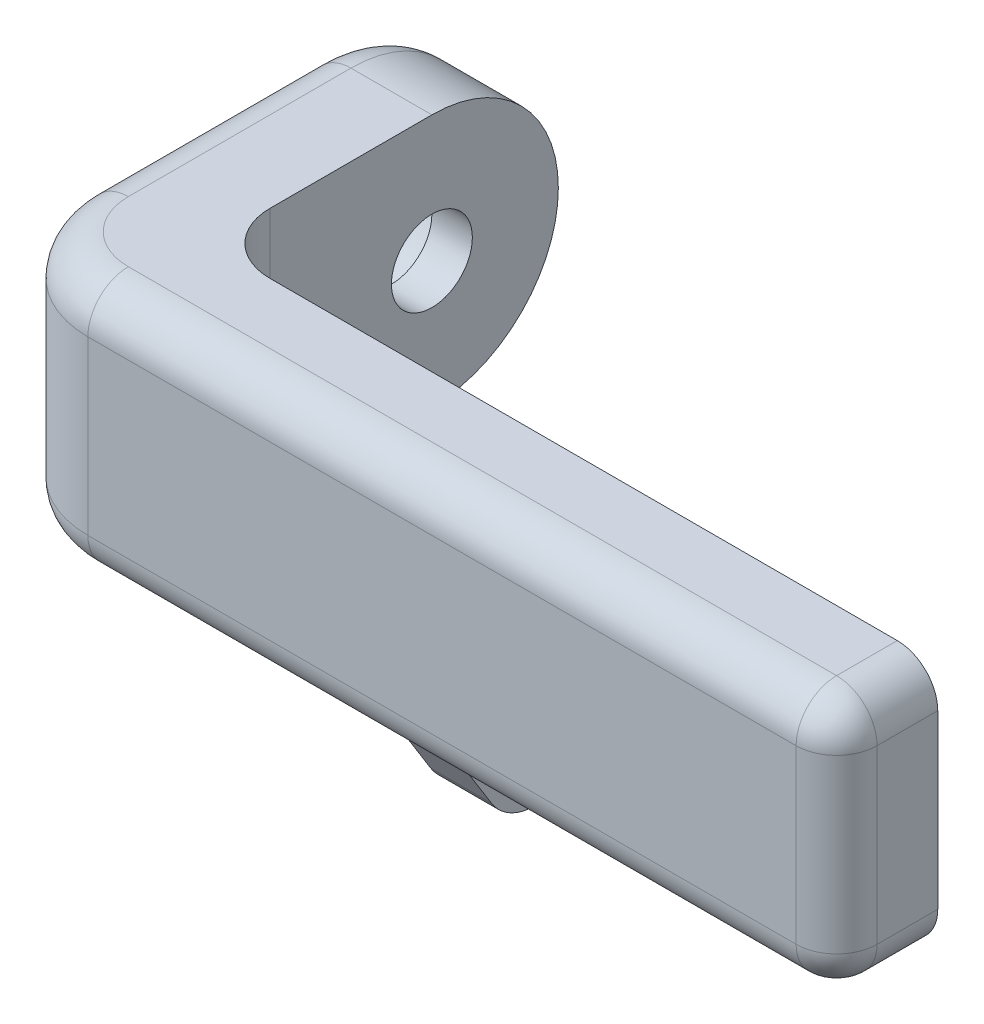
ISO-10303-21;
HEADER;
FILE_DESCRIPTION(('STEP AP214'),'2;1');
FILE_NAME('part.step','',(''),(''),'','','');
FILE_SCHEMA(('AUTOMOTIVE_DESIGN { 1 0 10303 214 1 1 1 1 }'));
ENDSEC;
DATA;
#1=APPLICATION_CONTEXT('core data for automotive mechanical design processes');
#2=APPLICATION_PROTOCOL_DEFINITION('international standard','automotive_design',2000,#1);
#3=PRODUCT_CONTEXT('',#1,'mechanical');
#4=PRODUCT('Part','Part','',(#3));
#5=PRODUCT_RELATED_PRODUCT_CATEGORY('part','',(#4));
#6=PRODUCT_DEFINITION_FORMATION('','',#4);
#7=PRODUCT_DEFINITION_CONTEXT('part definition',#1,'design');
#8=PRODUCT_DEFINITION('design','',#6,#7);
#9=PRODUCT_DEFINITION_SHAPE('','',#8);
#10=(LENGTH_UNIT() NAMED_UNIT(*) SI_UNIT(.MILLI.,.METRE.));
#11=(NAMED_UNIT(*) PLANE_ANGLE_UNIT() SI_UNIT($,.RADIAN.));
#12=(NAMED_UNIT(*) SI_UNIT($,.STERADIAN.) SOLID_ANGLE_UNIT());
#13=UNCERTAINTY_MEASURE_WITH_UNIT(LENGTH_MEASURE(1.E-05),#10,'distance_accuracy_value','');
#14=(GEOMETRIC_REPRESENTATION_CONTEXT(3) GLOBAL_UNCERTAINTY_ASSIGNED_CONTEXT((#13)) GLOBAL_UNIT_ASSIGNED_CONTEXT((#10,
#11,#12)) REPRESENTATION_CONTEXT('',''));
#15=CARTESIAN_POINT('',(0.,0.,0.));
#16=DIRECTION('',(0.,0.,1.));
#17=DIRECTION('',(1.,0.,0.));
#18=AXIS2_PLACEMENT_3D('',#15,#16,#17);
#19=CARTESIAN_POINT('',(24.,-12.5,32.));
#20=DIRECTION('',(0.,1.,0.));
#21=DIRECTION('',(0.,0.,1.));
#22=AXIS2_PLACEMENT_3D('',#19,#20,#21);
#23=PLANE('',#22);
#24=DIRECTION('',(0.,0.,-1.));
#25=VECTOR('',#24,1.);
#26=CARTESIAN_POINT('',(53.,-12.5,28.));
#27=LINE('',#26,#25);
#28=CARTESIAN_POINT('',(53.,-12.5,28.));
#29=VERTEX_POINT('',#28);
#30=CARTESIAN_POINT('',(53.,-12.5,22.));
#31=VERTEX_POINT('',#30);
#32=EDGE_CURVE('E227',#29,#31,#27,.T.);
#33=ORIENTED_EDGE('',*,*,#32,.T.);
#34=DIRECTION('',(-1.,0.,0.));
#35=VECTOR('',#34,1.);
#36=CARTESIAN_POINT('',(96.,-12.5,22.));
#37=LINE('',#36,#35);
#38=CARTESIAN_POINT('',(92.,-12.5,22.));
#39=VERTEX_POINT('',#38);
#40=EDGE_CURVE('E278',#39,#31,#37,.T.);
#41=ORIENTED_EDGE('',*,*,#40,.F.);
#42=DIRECTION('',(0.,0.,1.));
#43=VECTOR('',#42,1.);
#44=CARTESIAN_POINT('',(92.,-12.5,32.));
#45=LINE('',#44,#43);
#46=CARTESIAN_POINT('',(92.,-12.5,28.));
#47=VERTEX_POINT('',#46);
#48=EDGE_CURVE('E234',#47,#39,#45,.F.);
#49=ORIENTED_EDGE('',*,*,#48,.F.);
#50=DIRECTION('',(-1.,0.,0.));
#51=VECTOR('',#50,1.);
#52=CARTESIAN_POINT('',(24.,-12.5,28.));
#53=LINE('',#52,#51);
#54=EDGE_CURVE('E221',#29,#47,#53,.F.);
#55=ORIENTED_EDGE('',*,*,#54,.F.);
#56=EDGE_LOOP('',(#33,#41,#49,#55));
#57=FACE_BOUND('',#56,.T.);
#58=ADVANCED_FACE('F47',(#57),#23,.F.);
#59=DIRECTION('',(0.,0.,-1.));
#60=VECTOR('',#59,1.);
#61=CARTESIAN_POINT('',(47.,-12.5,28.));
#62=LINE('',#61,#60);
#63=CARTESIAN_POINT('',(47.,-12.5,28.));
#64=VERTEX_POINT('',#63);
#65=CARTESIAN_POINT('',(47.,-12.5,22.));
#66=VERTEX_POINT('',#65);
#67=EDGE_CURVE('E243',#64,#66,#62,.T.);
#68=ORIENTED_EDGE('',*,*,#67,.F.);
#69=CARTESIAN_POINT('',(22.,-12.5,28.));
#70=VERTEX_POINT('',#69);
#71=EDGE_CURVE('E224',#70,#64,#53,.F.);
#72=ORIENTED_EDGE('',*,*,#71,.F.);
#73=CARTESIAN_POINT('',(22.,-12.5,22.));
#74=DIRECTION('',(0.,-1.,0.));
#75=DIRECTION('',(0.,0.,1.));
#76=AXIS2_PLACEMENT_3D('',#73,#74,#75);
#77=CIRCLE('',#76,6.);
#78=CARTESIAN_POINT('',(16.,-12.5,22.));
#79=VERTEX_POINT('',#78);
#80=EDGE_CURVE('E381',#79,#70,#77,.F.);
#81=ORIENTED_EDGE('',*,*,#80,.F.);
#82=DIRECTION('',(0.,0.,-1.));
#83=VECTOR('',#82,1.);
#84=CARTESIAN_POINT('',(16.,-12.5,22.));
#85=LINE('',#84,#83);
#86=CARTESIAN_POINT('',(16.,-12.5,0.));
#87=VERTEX_POINT('',#86);
#88=EDGE_CURVE('E385',#87,#79,#85,.F.);
#89=ORIENTED_EDGE('',*,*,#88,.F.);
#90=DIRECTION('',(-1.,0.,0.));
#91=VECTOR('',#90,1.);
#92=CARTESIAN_POINT('',(24.,-12.5,0.));
#93=LINE('',#92,#91);
#94=CARTESIAN_POINT('',(24.,-12.5,0.));
#95=VERTEX_POINT('',#94);
#96=EDGE_CURVE('E285',#95,#87,#93,.T.);
#97=ORIENTED_EDGE('',*,*,#96,.F.);
#98=DIRECTION('',(0.,0.,-1.));
#99=VECTOR('',#98,1.);
#100=CARTESIAN_POINT('',(24.,-12.5,32.));
#101=LINE('',#100,#99);
#102=CARTESIAN_POINT('',(24.,-12.5,16.));
#103=VERTEX_POINT('',#102);
#104=EDGE_CURVE('E296',#103,#95,#101,.T.);
#105=ORIENTED_EDGE('',*,*,#104,.F.);
#106=CARTESIAN_POINT('',(30.,-12.5,16.));
#107=DIRECTION('',(0.,-1.,0.));
#108=DIRECTION('',(0.,0.,1.));
#109=AXIS2_PLACEMENT_3D('',#106,#107,#108);
#110=CIRCLE('',#109,6.);
#111=CARTESIAN_POINT('',(30.,-12.5,22.));
#112=VERTEX_POINT('',#111);
#113=EDGE_CURVE('E327',#112,#103,#110,.T.);
#114=ORIENTED_EDGE('',*,*,#113,.F.);
#115=EDGE_CURVE('E276',#66,#112,#37,.T.);
#116=ORIENTED_EDGE('',*,*,#115,.F.);
#117=EDGE_LOOP('',(#68,#72,#81,#89,#97,#105,#114,#116));
#118=FACE_BOUND('',#117,.T.);
#119=ADVANCED_FACE('F523',(#118),#23,.F.);
#120=CARTESIAN_POINT('',(96.,12.5,22.));
#121=DIRECTION('',(0.,0.,1.));
#122=DIRECTION('',(0.,-1.,0.));
#123=AXIS2_PLACEMENT_3D('',#120,#121,#122);
#124=PLANE('',#123);
#125=DIRECTION('',(0.,-1.,0.));
#126=VECTOR('',#125,1.);
#127=CARTESIAN_POINT('',(47.,0.,22.));
#128=LINE('',#127,#126);
#129=CARTESIAN_POINT('',(47.,0.,22.));
#130=VERTEX_POINT('',#129);
#131=EDGE_CURVE('E255',#130,#66,#128,.T.);
#132=ORIENTED_EDGE('',*,*,#131,.T.);
#133=ORIENTED_EDGE('',*,*,#115,.T.);
#134=DIRECTION('',(0.,-1.,0.));
#135=VECTOR('',#134,1.);
#136=CARTESIAN_POINT('',(30.,-12.5,22.));
#137=LINE('',#136,#135);
#138=CARTESIAN_POINT('',(30.,12.5,22.));
#139=VERTEX_POINT('',#138);
#140=EDGE_CURVE('E320',#139,#112,#137,.T.);
#141=ORIENTED_EDGE('',*,*,#140,.F.);
#142=DIRECTION('',(-1.,0.,0.));
#143=VECTOR('',#142,1.);
#144=CARTESIAN_POINT('',(96.,12.5,22.));
#145=LINE('',#144,#143);
#146=CARTESIAN_POINT('',(92.,12.5,22.));
#147=VERTEX_POINT('',#146);
#148=EDGE_CURVE('E281',#147,#139,#145,.T.);
#149=ORIENTED_EDGE('',*,*,#148,.F.);
#150=CARTESIAN_POINT('',(92.,8.5,22.));
#151=DIRECTION('',(0.,0.,-1.));
#152=DIRECTION('',(0.,-1.,0.));
#153=AXIS2_PLACEMENT_3D('',#150,#151,#152);
#154=CIRCLE('',#153,4.);
#155=CARTESIAN_POINT('',(96.,8.5,22.));
#156=VERTEX_POINT('',#155);
#157=EDGE_CURVE('E416',#156,#147,#154,.F.);
#158=ORIENTED_EDGE('',*,*,#157,.F.);
#159=DIRECTION('',(0.,-1.,0.));
#160=VECTOR('',#159,1.);
#161=CARTESIAN_POINT('',(96.,12.5,22.));
#162=LINE('',#161,#160);
#163=CARTESIAN_POINT('',(96.,-8.49999999999999,22.));
#164=VERTEX_POINT('',#163);
#165=EDGE_CURVE('E272',#156,#164,#162,.T.);
#166=ORIENTED_EDGE('',*,*,#165,.T.);
#167=CARTESIAN_POINT('',(92.,-8.5,22.));
#168=DIRECTION('',(0.,0.,-1.));
#169=DIRECTION('',(0.,-1.,0.));
#170=AXIS2_PLACEMENT_3D('',#167,#168,#169);
#171=CIRCLE('',#170,4.);
#172=EDGE_CURVE('E420',#39,#164,#171,.F.);
#173=ORIENTED_EDGE('',*,*,#172,.F.);
#174=ORIENTED_EDGE('',*,*,#40,.T.);
#175=DIRECTION('',(0.,1.,0.));
#176=VECTOR('',#175,1.);
#177=CARTESIAN_POINT('',(53.,12.5,22.));
#178=LINE('',#177,#176);
#179=CARTESIAN_POINT('',(53.,0.,22.));
#180=VERTEX_POINT('',#179);
#181=EDGE_CURVE('E240',#31,#180,#178,.T.);
#182=ORIENTED_EDGE('',*,*,#181,.T.);
#183=DIRECTION('',(-1.,0.,0.));
#184=VECTOR('',#183,1.);
#185=CARTESIAN_POINT('',(47.,0.,22.));
#186=LINE('',#185,#184);
#187=EDGE_CURVE('E261',#180,#130,#186,.T.);
#188=ORIENTED_EDGE('',*,*,#187,.T.);
#189=EDGE_LOOP('',(#132,#133,#141,#149,#158,#166,#173,#174,#182,#188));
#190=FACE_BOUND('',#189,.T.);
#191=ADVANCED_FACE('F528',(#190),#124,.F.);
#192=CARTESIAN_POINT('',(24.,0.,0.));
#193=DIRECTION('',(-1.,0.,0.));
#194=DIRECTION('',(0.,0.,-1.));
#195=AXIS2_PLACEMENT_3D('',#192,#193,#194);
#196=PLANE('',#195);
#197=CARTESIAN_POINT('',(24.,0.,0.));
#198=DIRECTION('',(1.,0.,0.));
#199=DIRECTION('',(0.,0.,-1.));
#200=AXIS2_PLACEMENT_3D('',#197,#198,#199);
#201=CIRCLE('',#200,4.);
#202=CARTESIAN_POINT('',(24.,0.,-4.));
#203=VERTEX_POINT('',#202);
#204=EDGE_CURVE('E300',#203,#203,#201,.T.);
#205=ORIENTED_EDGE('',*,*,#204,.F.);
#206=EDGE_LOOP('',(#205));
#207=FACE_BOUND('',#206,.T.);
#208=ORIENTED_EDGE('',*,*,#104,.T.);
#209=CARTESIAN_POINT('',(24.,0.,0.));
#210=DIRECTION('',(1.,0.,0.));
#211=DIRECTION('',(0.,0.,-1.));
#212=AXIS2_PLACEMENT_3D('',#209,#210,#211);
#213=CIRCLE('',#212,12.5);
#214=CARTESIAN_POINT('',(24.,12.5,0.));
#215=VERTEX_POINT('',#214);
#216=EDGE_CURVE('E305',#95,#215,#213,.T.);
#217=ORIENTED_EDGE('',*,*,#216,.T.);
#218=DIRECTION('',(0.,0.,-1.));
#219=VECTOR('',#218,1.);
#220=CARTESIAN_POINT('',(24.,12.5,32.));
#221=LINE('',#220,#219);
#222=CARTESIAN_POINT('',(24.,12.5,16.));
#223=VERTEX_POINT('',#222);
#224=EDGE_CURVE('E292',#223,#215,#221,.T.);
#225=ORIENTED_EDGE('',*,*,#224,.F.);
#226=DIRECTION('',(0.,-1.,0.));
#227=VECTOR('',#226,1.);
#228=CARTESIAN_POINT('',(24.,12.5,16.));
#229=LINE('',#228,#227);
#230=EDGE_CURVE('E323',#103,#223,#229,.F.);
#231=ORIENTED_EDGE('',*,*,#230,.F.);
#232=EDGE_LOOP('',(#208,#217,#225,#231));
#233=FACE_BOUND('',#232,.T.);
#234=ADVANCED_FACE('F547',(#207,#233),#196,.F.);
#235=CARTESIAN_POINT('',(12.,0.,0.));
#236=DIRECTION('',(-1.,0.,0.));
#237=DIRECTION('',(0.,0.,-1.));
#238=AXIS2_PLACEMENT_3D('',#235,#236,#237);
#239=PLANE('',#238);
#240=DIRECTION('',(0.,1.,0.));
#241=VECTOR('',#240,1.);
#242=CARTESIAN_POINT('',(12.,-12.5,22.));
#243=LINE('',#242,#241);
#244=CARTESIAN_POINT('',(12.,8.5,22.));
#245=VERTEX_POINT('',#244);
#246=CARTESIAN_POINT('',(12.,-8.5,22.));
#247=VERTEX_POINT('',#246);
#248=EDGE_CURVE('E338',#245,#247,#243,.F.);
#249=ORIENTED_EDGE('',*,*,#248,.F.);
#250=DIRECTION('',(0.,0.,-1.));
#251=VECTOR('',#250,1.);
#252=CARTESIAN_POINT('',(12.,8.5,22.));
#253=LINE('',#252,#251);
#254=CARTESIAN_POINT('',(12.,8.5,0.));
#255=VERTEX_POINT('',#254);
#256=EDGE_CURVE('E389',#255,#245,#253,.F.);
#257=ORIENTED_EDGE('',*,*,#256,.F.);
#258=CARTESIAN_POINT('',(12.,0.,0.));
#259=DIRECTION('',(1.,0.,0.));
#260=DIRECTION('',(0.,0.,-1.));
#261=AXIS2_PLACEMENT_3D('',#258,#259,#260);
#262=CIRCLE('',#261,8.5);
#263=CARTESIAN_POINT('',(12.,-8.5,0.));
#264=VERTEX_POINT('',#263);
#265=EDGE_CURVE('E393',#264,#255,#262,.T.);
#266=ORIENTED_EDGE('',*,*,#265,.F.);
#267=DIRECTION('',(0.,0.,-1.));
#268=VECTOR('',#267,1.);
#269=CARTESIAN_POINT('',(12.,-8.5,0.));
#270=LINE('',#269,#268);
#271=EDGE_CURVE('E397',#247,#264,#270,.T.);
#272=ORIENTED_EDGE('',*,*,#271,.F.);
#273=EDGE_LOOP('',(#249,#257,#266,#272));
#274=FACE_BOUND('',#273,.T.);
#275=CARTESIAN_POINT('',(12.,0.,0.));
#276=DIRECTION('',(1.,0.,0.));
#277=DIRECTION('',(0.,0.,-1.));
#278=AXIS2_PLACEMENT_3D('',#275,#276,#277);
#279=CIRCLE('',#278,7.5);
#280=CARTESIAN_POINT('',(12.,0.,-7.5));
#281=VERTEX_POINT('',#280);
#282=EDGE_CURVE('E309',#281,#281,#279,.T.);
#283=ORIENTED_EDGE('',*,*,#282,.T.);
#284=EDGE_LOOP('',(#283));
#285=FACE_BOUND('',#284,.T.);
#286=ADVANCED_FACE('F543',(#274,#285),#239,.T.);
#287=CARTESIAN_POINT('',(12.,0.,0.));
#288=DIRECTION('',(1.,0.,0.));
#289=DIRECTION('',(0.,0.,1.));
#290=AXIS2_PLACEMENT_3D('',#287,#288,#289);
#291=CYLINDRICAL_SURFACE('',#290,7.5);
#292=ORIENTED_EDGE('',*,*,#282,.F.);
#293=EDGE_LOOP('',(#292));
#294=FACE_BOUND('',#293,.T.);
#295=CARTESIAN_POINT('',(20.,0.,0.));
#296=DIRECTION('',(1.,0.,0.));
#297=DIRECTION('',(0.,0.,-1.));
#298=AXIS2_PLACEMENT_3D('',#295,#296,#297);
#299=CIRCLE('',#298,7.5);
#300=CARTESIAN_POINT('',(20.,0.,-7.5));
#301=VERTEX_POINT('',#300);
#302=EDGE_CURVE('E313',#301,#301,#299,.T.);
#303=ORIENTED_EDGE('',*,*,#302,.T.);
#304=EDGE_LOOP('',(#303));
#305=FACE_BOUND('',#304,.T.);
#306=ADVANCED_FACE('F546',(#294,#305),#291,.F.);
#307=CARTESIAN_POINT('',(12.,0.,0.));
#308=DIRECTION('',(1.,0.,0.));
#309=DIRECTION('',(0.,0.,1.));
#310=AXIS2_PLACEMENT_3D('',#307,#308,#309);
#311=CYLINDRICAL_SURFACE('',#310,12.5);
#312=DIRECTION('',(1.,0.,0.));
#313=VECTOR('',#312,1.);
#314=CARTESIAN_POINT('',(24.,12.5,0.));
#315=LINE('',#314,#313);
#316=CARTESIAN_POINT('',(16.,12.5,0.));
#317=VERTEX_POINT('',#316);
#318=EDGE_CURVE('E289',#317,#215,#315,.T.);
#319=ORIENTED_EDGE('',*,*,#318,.T.);
#320=ORIENTED_EDGE('',*,*,#216,.F.);
#321=ORIENTED_EDGE('',*,*,#96,.T.);
#322=CARTESIAN_POINT('',(16.,0.,0.));
#323=DIRECTION('',(1.,0.,0.));
#324=DIRECTION('',(0.,0.,-1.));
#325=AXIS2_PLACEMENT_3D('',#322,#323,#324);
#326=CIRCLE('',#325,12.5);
#327=EDGE_CURVE('E401',#317,#87,#326,.F.);
#328=ORIENTED_EDGE('',*,*,#327,.F.);
#329=EDGE_LOOP('',(#319,#320,#321,#328));
#330=FACE_BOUND('',#329,.T.);
#331=ADVANCED_FACE('F541',(#330),#311,.T.);
#332=CARTESIAN_POINT('',(20.,0.,0.));
#333=DIRECTION('',(1.,0.,0.));
#334=DIRECTION('',(0.,0.,1.));
#335=AXIS2_PLACEMENT_3D('',#332,#333,#334);
#336=CYLINDRICAL_SURFACE('',#335,4.);
#337=CARTESIAN_POINT('',(20.,0.,0.));
#338=DIRECTION('',(1.,0.,0.));
#339=DIRECTION('',(0.,0.,-1.));
#340=AXIS2_PLACEMENT_3D('',#337,#338,#339);
#341=CIRCLE('',#340,4.);
#342=CARTESIAN_POINT('',(20.,0.,-4.));
#343=VERTEX_POINT('',#342);
#344=EDGE_CURVE('E301',#343,#343,#341,.T.);
#345=ORIENTED_EDGE('',*,*,#344,.F.);
#346=EDGE_LOOP('',(#345));
#347=FACE_BOUND('',#346,.T.);
#348=ORIENTED_EDGE('',*,*,#204,.T.);
#349=EDGE_LOOP('',(#348));
#350=FACE_BOUND('',#349,.T.);
#351=ADVANCED_FACE('F537',(#347,#350),#336,.F.);
#352=CARTESIAN_POINT('',(20.,0.,0.));
#353=DIRECTION('',(-1.,0.,0.));
#354=DIRECTION('',(0.,0.,-1.));
#355=AXIS2_PLACEMENT_3D('',#352,#353,#354);
#356=PLANE('',#355);
#357=ORIENTED_EDGE('',*,*,#302,.F.);
#358=EDGE_LOOP('',(#357));
#359=FACE_BOUND('',#358,.T.);
#360=ORIENTED_EDGE('',*,*,#344,.T.);
#361=EDGE_LOOP('',(#360));
#362=FACE_BOUND('',#361,.T.);
#363=ADVANCED_FACE('F534',(#359,#362),#356,.T.);
#364=CARTESIAN_POINT('',(24.,12.5,32.));
#365=DIRECTION('',(0.,-1.,0.));
#366=DIRECTION('',(0.,0.,-1.));
#367=AXIS2_PLACEMENT_3D('',#364,#365,#366);
#368=PLANE('',#367);
#369=ORIENTED_EDGE('',*,*,#148,.T.);
#370=CARTESIAN_POINT('',(30.,12.5,16.));
#371=DIRECTION('',(0.,1.,0.));
#372=DIRECTION('',(0.,0.,-1.));
#373=AXIS2_PLACEMENT_3D('',#370,#371,#372);
#374=CIRCLE('',#373,6.);
#375=EDGE_CURVE('E331',#223,#139,#374,.T.);
#376=ORIENTED_EDGE('',*,*,#375,.F.);
#377=ORIENTED_EDGE('',*,*,#224,.T.);
#378=ORIENTED_EDGE('',*,*,#318,.F.);
#379=DIRECTION('',(0.,0.,-1.));
#380=VECTOR('',#379,1.);
#381=CARTESIAN_POINT('',(16.,12.5,0.));
#382=LINE('',#381,#380);
#383=CARTESIAN_POINT('',(16.,12.5,22.));
#384=VERTEX_POINT('',#383);
#385=EDGE_CURVE('E354',#384,#317,#382,.T.);
#386=ORIENTED_EDGE('',*,*,#385,.F.);
#387=CARTESIAN_POINT('',(22.,12.5,22.));
#388=DIRECTION('',(0.,1.,0.));
#389=DIRECTION('',(0.,0.,-1.));
#390=AXIS2_PLACEMENT_3D('',#387,#388,#389);
#391=CIRCLE('',#390,6.);
#392=CARTESIAN_POINT('',(22.,12.5,28.));
#393=VERTEX_POINT('',#392);
#394=EDGE_CURVE('E358',#393,#384,#391,.F.);
#395=ORIENTED_EDGE('',*,*,#394,.F.);
#396=DIRECTION('',(1.,0.,0.));
#397=VECTOR('',#396,1.);
#398=CARTESIAN_POINT('',(24.,12.5,28.));
#399=LINE('',#398,#397);
#400=CARTESIAN_POINT('',(92.,12.5,28.));
#401=VERTEX_POINT('',#400);
#402=EDGE_CURVE('E362',#401,#393,#399,.F.);
#403=ORIENTED_EDGE('',*,*,#402,.F.);
#404=DIRECTION('',(0.,0.,-1.));
#405=VECTOR('',#404,1.);
#406=CARTESIAN_POINT('',(92.,12.5,32.));
#407=LINE('',#406,#405);
#408=EDGE_CURVE('E366',#147,#401,#407,.F.);
#409=ORIENTED_EDGE('',*,*,#408,.F.);
#410=EDGE_LOOP('',(#369,#376,#377,#378,#386,#395,#403,#409));
#411=FACE_BOUND('',#410,.T.);
#412=ADVANCED_FACE('F532',(#411),#368,.F.);
#413=CARTESIAN_POINT('',(24.,0.,32.));
#414=DIRECTION('',(0.,0.,-1.));
#415=DIRECTION('',(1.,0.,0.));
#416=AXIS2_PLACEMENT_3D('',#413,#414,#415);
#417=PLANE('',#416);
#418=DIRECTION('',(0.,1.,0.));
#419=VECTOR('',#418,1.);
#420=CARTESIAN_POINT('',(22.,12.5,32.));
#421=LINE('',#420,#419);
#422=CARTESIAN_POINT('',(22.,-8.5,32.));
#423=VERTEX_POINT('',#422);
#424=CARTESIAN_POINT('',(22.,8.5,32.));
#425=VERTEX_POINT('',#424);
#426=EDGE_CURVE('E334',#423,#425,#421,.T.);
#427=ORIENTED_EDGE('',*,*,#426,.F.);
#428=DIRECTION('',(-1.,0.,0.));
#429=VECTOR('',#428,1.);
#430=CARTESIAN_POINT('',(24.,-8.5,32.));
#431=LINE('',#430,#429);
#432=CARTESIAN_POINT('',(92.,-8.5,32.));
#433=VERTEX_POINT('',#432);
#434=EDGE_CURVE('E346',#433,#423,#431,.T.);
#435=ORIENTED_EDGE('',*,*,#434,.F.);
#436=DIRECTION('',(0.,1.,0.));
#437=VECTOR('',#436,1.);
#438=CARTESIAN_POINT('',(92.,0.,32.));
#439=LINE('',#438,#437);
#440=CARTESIAN_POINT('',(92.,8.5,32.));
#441=VERTEX_POINT('',#440);
#442=EDGE_CURVE('E342',#441,#433,#439,.F.);
#443=ORIENTED_EDGE('',*,*,#442,.F.);
#444=DIRECTION('',(1.,0.,0.));
#445=VECTOR('',#444,1.);
#446=CARTESIAN_POINT('',(24.,8.5,32.));
#447=LINE('',#446,#445);
#448=EDGE_CURVE('E350',#425,#441,#447,.T.);
#449=ORIENTED_EDGE('',*,*,#448,.F.);
#450=EDGE_LOOP('',(#427,#435,#443,#449));
#451=FACE_BOUND('',#450,.T.);
#452=ADVANCED_FACE('F624',(#451),#417,.F.);
#453=CARTESIAN_POINT('',(96.,0.,0.));
#454=DIRECTION('',(-1.,0.,0.));
#455=DIRECTION('',(0.,0.,-1.));
#456=AXIS2_PLACEMENT_3D('',#453,#454,#455);
#457=PLANE('',#456);
#458=ORIENTED_EDGE('',*,*,#165,.F.);
#459=DIRECTION('',(0.,0.,-1.));
#460=VECTOR('',#459,1.);
#461=CARTESIAN_POINT('',(96.,8.5,0.));
#462=LINE('',#461,#460);
#463=CARTESIAN_POINT('',(96.,8.5,28.));
#464=VERTEX_POINT('',#463);
#465=EDGE_CURVE('E409',#464,#156,#462,.T.);
#466=ORIENTED_EDGE('',*,*,#465,.F.);
#467=DIRECTION('',(0.,1.,0.));
#468=VECTOR('',#467,1.);
#469=CARTESIAN_POINT('',(96.,0.,28.));
#470=LINE('',#469,#468);
#471=CARTESIAN_POINT('',(96.,-8.5,28.));
#472=VERTEX_POINT('',#471);
#473=EDGE_CURVE('E405',#472,#464,#470,.T.);
#474=ORIENTED_EDGE('',*,*,#473,.F.);
#475=DIRECTION('',(0.,0.,1.));
#476=VECTOR('',#475,1.);
#477=CARTESIAN_POINT('',(96.,-8.5,0.));
#478=LINE('',#477,#476);
#479=EDGE_CURVE('E412',#164,#472,#478,.T.);
#480=ORIENTED_EDGE('',*,*,#479,.F.);
#481=EDGE_LOOP('',(#458,#466,#474,#480));
#482=FACE_BOUND('',#481,.T.);
#483=ADVANCED_FACE('F562',(#482),#457,.F.);
#484=CARTESIAN_POINT('',(30.,12.5,16.));
#485=DIRECTION('',(0.,1.,0.));
#486=DIRECTION('',(0.,0.,1.));
#487=AXIS2_PLACEMENT_3D('',#484,#485,#486);
#488=CYLINDRICAL_SURFACE('',#487,6.);
#489=ORIENTED_EDGE('',*,*,#375,.T.);
#490=ORIENTED_EDGE('',*,*,#140,.T.);
#491=ORIENTED_EDGE('',*,*,#113,.T.);
#492=ORIENTED_EDGE('',*,*,#230,.T.);
#493=EDGE_LOOP('',(#489,#490,#491,#492));
#494=FACE_BOUND('',#493,.T.);
#495=ADVANCED_FACE('F558',(#494),#488,.F.);
#496=CARTESIAN_POINT('',(22.,0.,22.));
#497=DIRECTION('',(0.,-1.,0.));
#498=DIRECTION('',(0.,0.,-1.));
#499=AXIS2_PLACEMENT_3D('',#496,#497,#498);
#500=CYLINDRICAL_SURFACE('',#499,10.);
#501=ORIENTED_EDGE('',*,*,#248,.T.);
#502=CARTESIAN_POINT('',(22.,-8.5,22.));
#503=DIRECTION('',(0.,-1.,0.));
#504=DIRECTION('',(0.,0.,1.));
#505=AXIS2_PLACEMENT_3D('',#502,#503,#504);
#506=CIRCLE('',#505,10.);
#507=EDGE_CURVE('E370',#423,#247,#506,.T.);
#508=ORIENTED_EDGE('',*,*,#507,.F.);
#509=ORIENTED_EDGE('',*,*,#426,.T.);
#510=CARTESIAN_POINT('',(22.,8.5,22.));
#511=DIRECTION('',(0.,1.,0.));
#512=DIRECTION('',(0.,0.,-1.));
#513=AXIS2_PLACEMENT_3D('',#510,#511,#512);
#514=CIRCLE('',#513,10.);
#515=EDGE_CURVE('E374',#245,#425,#514,.T.);
#516=ORIENTED_EDGE('',*,*,#515,.F.);
#517=EDGE_LOOP('',(#501,#508,#509,#516));
#518=FACE_BOUND('',#517,.T.);
#519=ADVANCED_FACE('F561',(#518),#500,.T.);
#520=CARTESIAN_POINT('',(22.,-8.5,22.));
#521=DIRECTION('',(0.,1.,0.));
#522=DIRECTION('',(0.,0.,1.));
#523=AXIS2_PLACEMENT_3D('',#520,#521,#522);
#524=TOROIDAL_SURFACE('',#523,6.,4.);
#525=CARTESIAN_POINT('',(22.,-8.5,28.));
#526=DIRECTION('',(-1.,0.,0.));
#527=DIRECTION('',(0.,0.,1.));
#528=AXIS2_PLACEMENT_3D('',#525,#526,#527);
#529=CIRCLE('',#528,4.);
#530=EDGE_CURVE('E454',#70,#423,#529,.T.);
#531=ORIENTED_EDGE('',*,*,#530,.T.);
#532=ORIENTED_EDGE('',*,*,#507,.T.);
#533=CARTESIAN_POINT('',(16.,-8.5,22.));
#534=DIRECTION('',(0.,0.,1.));
#535=DIRECTION('',(1.,0.,0.));
#536=AXIS2_PLACEMENT_3D('',#533,#534,#535);
#537=CIRCLE('',#536,4.);
#538=EDGE_CURVE('E277',#247,#79,#537,.T.);
#539=ORIENTED_EDGE('',*,*,#538,.T.);
#540=ORIENTED_EDGE('',*,*,#80,.T.);
#541=EDGE_LOOP('',(#531,#532,#539,#540));
#542=FACE_BOUND('',#541,.T.);
#543=ADVANCED_FACE('F566',(#542),#524,.T.);
#544=CARTESIAN_POINT('',(16.,-8.5,0.));
#545=DIRECTION('',(0.,0.,1.));
#546=DIRECTION('',(-1.,0.,0.));
#547=AXIS2_PLACEMENT_3D('',#544,#545,#546);
#548=CYLINDRICAL_SURFACE('',#547,4.);
#549=ORIENTED_EDGE('',*,*,#538,.F.);
#550=ORIENTED_EDGE('',*,*,#271,.T.);
#551=CARTESIAN_POINT('',(16.,-8.5,0.));
#552=DIRECTION('',(0.,0.,1.));
#553=DIRECTION('',(1.,0.,0.));
#554=AXIS2_PLACEMENT_3D('',#551,#552,#553);
#555=CIRCLE('',#554,4.);
#556=EDGE_CURVE('E451',#264,#87,#555,.T.);
#557=ORIENTED_EDGE('',*,*,#556,.T.);
#558=ORIENTED_EDGE('',*,*,#88,.T.);
#559=EDGE_LOOP('',(#549,#550,#557,#558));
#560=FACE_BOUND('',#559,.T.);
#561=ADVANCED_FACE('F606',(#560),#548,.T.);
#562=CARTESIAN_POINT('',(24.,-8.5,28.));
#563=DIRECTION('',(-1.,0.,0.));
#564=DIRECTION('',(0.,0.,-1.));
#565=AXIS2_PLACEMENT_3D('',#562,#563,#564);
#566=CYLINDRICAL_SURFACE('',#565,4.);
#567=ORIENTED_EDGE('',*,*,#530,.F.);
#568=ORIENTED_EDGE('',*,*,#71,.T.);
#569=DIRECTION('',(1.,0.,0.));
#570=VECTOR('',#569,1.);
#571=CARTESIAN_POINT('',(53.,-12.5,28.));
#572=LINE('',#571,#570);
#573=EDGE_CURVE('E205',#64,#29,#572,.T.);
#574=ORIENTED_EDGE('',*,*,#573,.T.);
#575=ORIENTED_EDGE('',*,*,#54,.T.);
#576=CARTESIAN_POINT('',(92.,-8.5,28.));
#577=DIRECTION('',(-1.,0.,0.));
#578=DIRECTION('',(0.,0.,1.));
#579=AXIS2_PLACEMENT_3D('',#576,#577,#578);
#580=CIRCLE('',#579,4.);
#581=EDGE_CURVE('E448',#47,#433,#580,.T.);
#582=ORIENTED_EDGE('',*,*,#581,.T.);
#583=ORIENTED_EDGE('',*,*,#434,.T.);
#584=EDGE_LOOP('',(#567,#568,#574,#575,#582,#583));
#585=FACE_BOUND('',#584,.T.);
#586=ADVANCED_FACE('F219',(#585),#566,.T.);
#587=CARTESIAN_POINT('',(92.,-8.5,0.));
#588=DIRECTION('',(0.,0.,1.));
#589=DIRECTION('',(-1.,0.,0.));
#590=AXIS2_PLACEMENT_3D('',#587,#588,#589);
#591=CYLINDRICAL_SURFACE('',#590,4.);
#592=ORIENTED_EDGE('',*,*,#172,.T.);
#593=ORIENTED_EDGE('',*,*,#479,.T.);
#594=CARTESIAN_POINT('',(92.,-8.5,28.));
#595=DIRECTION('',(0.,0.,-1.));
#596=DIRECTION('',(-1.,0.,0.));
#597=AXIS2_PLACEMENT_3D('',#594,#595,#596);
#598=CIRCLE('',#597,4.);
#599=EDGE_CURVE('E445',#472,#47,#598,.T.);
#600=ORIENTED_EDGE('',*,*,#599,.T.);
#601=ORIENTED_EDGE('',*,*,#48,.T.);
#602=EDGE_LOOP('',(#592,#593,#600,#601));
#603=FACE_BOUND('',#602,.T.);
#604=ADVANCED_FACE('F599',(#603),#591,.T.);
#605=CARTESIAN_POINT('',(16.,0.,0.));
#606=DIRECTION('',(-1.,0.,0.));
#607=DIRECTION('',(0.,0.,-1.));
#608=AXIS2_PLACEMENT_3D('',#605,#606,#607);
#609=TOROIDAL_SURFACE('',#608,8.5,4.);
#610=ORIENTED_EDGE('',*,*,#556,.F.);
#611=ORIENTED_EDGE('',*,*,#265,.T.);
#612=CARTESIAN_POINT('',(16.,8.5,0.));
#613=DIRECTION('',(0.,0.,-1.));
#614=DIRECTION('',(-1.,0.,0.));
#615=AXIS2_PLACEMENT_3D('',#612,#613,#614);
#616=CIRCLE('',#615,4.);
#617=EDGE_CURVE('E442',#255,#317,#616,.T.);
#618=ORIENTED_EDGE('',*,*,#617,.T.);
#619=ORIENTED_EDGE('',*,*,#327,.T.);
#620=EDGE_LOOP('',(#610,#611,#618,#619));
#621=FACE_BOUND('',#620,.T.);
#622=ADVANCED_FACE('F595',(#621),#609,.T.);
#623=CARTESIAN_POINT('',(92.,-8.5,28.));
#624=DIRECTION('',(0.,-1.,0.));
#625=DIRECTION('',(0.,0.,-1.));
#626=AXIS2_PLACEMENT_3D('',#623,#624,#625);
#627=SPHERICAL_SURFACE('',#626,4.);
#628=ORIENTED_EDGE('',*,*,#599,.F.);
#629=CARTESIAN_POINT('',(92.,-8.5,28.));
#630=DIRECTION('',(0.,1.,0.));
#631=DIRECTION('',(0.,0.,-1.));
#632=AXIS2_PLACEMENT_3D('',#629,#630,#631);
#633=CIRCLE('',#632,4.);
#634=EDGE_CURVE('E439',#472,#433,#633,.F.);
#635=ORIENTED_EDGE('',*,*,#634,.T.);
#636=ORIENTED_EDGE('',*,*,#581,.F.);
#637=EDGE_LOOP('',(#628,#635,#636));
#638=FACE_BOUND('',#637,.T.);
#639=ADVANCED_FACE('F591',(#638),#627,.T.);
#640=CARTESIAN_POINT('',(16.,8.5,32.));
#641=DIRECTION('',(0.,0.,1.));
#642=DIRECTION('',(-1.,0.,0.));
#643=AXIS2_PLACEMENT_3D('',#640,#641,#642);
#644=CYLINDRICAL_SURFACE('',#643,4.);
#645=ORIENTED_EDGE('',*,*,#617,.F.);
#646=ORIENTED_EDGE('',*,*,#256,.T.);
#647=CARTESIAN_POINT('',(16.,8.5,22.));
#648=DIRECTION('',(0.,0.,-1.));
#649=DIRECTION('',(-1.,0.,0.));
#650=AXIS2_PLACEMENT_3D('',#647,#648,#649);
#651=CIRCLE('',#650,4.);
#652=EDGE_CURVE('E436',#245,#384,#651,.T.);
#653=ORIENTED_EDGE('',*,*,#652,.T.);
#654=ORIENTED_EDGE('',*,*,#385,.T.);
#655=EDGE_LOOP('',(#645,#646,#653,#654));
#656=FACE_BOUND('',#655,.T.);
#657=ADVANCED_FACE('F587',(#656),#644,.T.);
#658=CARTESIAN_POINT('',(92.,0.,28.));
#659=DIRECTION('',(0.,1.,0.));
#660=DIRECTION('',(0.,0.,1.));
#661=AXIS2_PLACEMENT_3D('',#658,#659,#660);
#662=CYLINDRICAL_SURFACE('',#661,4.);
#663=ORIENTED_EDGE('',*,*,#634,.F.);
#664=ORIENTED_EDGE('',*,*,#473,.T.);
#665=CARTESIAN_POINT('',(92.,8.5,28.));
#666=DIRECTION('',(0.,-1.,0.));
#667=DIRECTION('',(0.,0.,1.));
#668=AXIS2_PLACEMENT_3D('',#665,#666,#667);
#669=CIRCLE('',#668,4.);
#670=EDGE_CURVE('E432',#464,#441,#669,.T.);
#671=ORIENTED_EDGE('',*,*,#670,.T.);
#672=ORIENTED_EDGE('',*,*,#442,.T.);
#673=EDGE_LOOP('',(#663,#664,#671,#672));
#674=FACE_BOUND('',#673,.T.);
#675=ADVANCED_FACE('F583',(#674),#662,.T.);
#676=CARTESIAN_POINT('',(92.,8.5,0.));
#677=DIRECTION('',(0.,0.,-1.));
#678=DIRECTION('',(1.,0.,0.));
#679=AXIS2_PLACEMENT_3D('',#676,#677,#678);
#680=CYLINDRICAL_SURFACE('',#679,4.);
#681=ORIENTED_EDGE('',*,*,#157,.T.);
#682=ORIENTED_EDGE('',*,*,#408,.T.);
#683=CARTESIAN_POINT('',(92.,8.5,28.));
#684=DIRECTION('',(0.,0.,-1.));
#685=DIRECTION('',(-1.,0.,0.));
#686=AXIS2_PLACEMENT_3D('',#683,#684,#685);
#687=CIRCLE('',#686,4.);
#688=EDGE_CURVE('E429',#401,#464,#687,.T.);
#689=ORIENTED_EDGE('',*,*,#688,.T.);
#690=ORIENTED_EDGE('',*,*,#465,.T.);
#691=EDGE_LOOP('',(#681,#682,#689,#690));
#692=FACE_BOUND('',#691,.T.);
#693=ADVANCED_FACE('F579',(#692),#680,.T.);
#694=CARTESIAN_POINT('',(22.,8.5,22.));
#695=DIRECTION('',(0.,-1.,0.));
#696=DIRECTION('',(0.,0.,-1.));
#697=AXIS2_PLACEMENT_3D('',#694,#695,#696);
#698=TOROIDAL_SURFACE('',#697,6.,4.);
#699=ORIENTED_EDGE('',*,*,#652,.F.);
#700=ORIENTED_EDGE('',*,*,#515,.T.);
#701=CARTESIAN_POINT('',(22.,8.5,28.));
#702=DIRECTION('',(-1.,0.,0.));
#703=DIRECTION('',(0.,0.,1.));
#704=AXIS2_PLACEMENT_3D('',#701,#702,#703);
#705=CIRCLE('',#704,4.);
#706=EDGE_CURVE('E426',#425,#393,#705,.T.);
#707=ORIENTED_EDGE('',*,*,#706,.T.);
#708=ORIENTED_EDGE('',*,*,#394,.T.);
#709=EDGE_LOOP('',(#699,#700,#707,#708));
#710=FACE_BOUND('',#709,.T.);
#711=ADVANCED_FACE('F575',(#710),#698,.T.);
#712=CARTESIAN_POINT('',(92.,8.5,28.));
#713=DIRECTION('',(1.,0.,0.));
#714=DIRECTION('',(0.,0.,1.));
#715=AXIS2_PLACEMENT_3D('',#712,#713,#714);
#716=SPHERICAL_SURFACE('',#715,4.);
#717=ORIENTED_EDGE('',*,*,#688,.F.);
#718=CARTESIAN_POINT('',(92.,8.5,28.));
#719=DIRECTION('',(-1.,0.,0.));
#720=DIRECTION('',(0.,0.,1.));
#721=AXIS2_PLACEMENT_3D('',#718,#719,#720);
#722=CIRCLE('',#721,4.);
#723=EDGE_CURVE('E271',#401,#441,#722,.F.);
#724=ORIENTED_EDGE('',*,*,#723,.T.);
#725=ORIENTED_EDGE('',*,*,#670,.F.);
#726=EDGE_LOOP('',(#717,#724,#725));
#727=FACE_BOUND('',#726,.T.);
#728=ADVANCED_FACE('F571',(#727),#716,.T.);
#729=CARTESIAN_POINT('',(24.,8.5,28.));
#730=DIRECTION('',(1.,0.,0.));
#731=DIRECTION('',(0.,0.,1.));
#732=AXIS2_PLACEMENT_3D('',#729,#730,#731);
#733=CYLINDRICAL_SURFACE('',#732,4.);
#734=ORIENTED_EDGE('',*,*,#706,.F.);
#735=ORIENTED_EDGE('',*,*,#448,.T.);
#736=ORIENTED_EDGE('',*,*,#723,.F.);
#737=ORIENTED_EDGE('',*,*,#402,.T.);
#738=EDGE_LOOP('',(#734,#735,#736,#737));
#739=FACE_BOUND('',#738,.T.);
#740=ADVANCED_FACE('F568',(#739),#733,.T.);
#741=CARTESIAN_POINT('',(47.,0.,-13.));
#742=DIRECTION('',(1.,0.,0.));
#743=DIRECTION('',(0.,-1.,0.));
#744=AXIS2_PLACEMENT_3D('',#741,#742,#743);
#745=PLANE('',#744);
#746=DIRECTION('',(0.,0.849407893683524,0.527736894814186));
#747=VECTOR('',#746,1.);
#748=CARTESIAN_POINT('',(47.,-12.5,28.));
#749=LINE('',#748,#747);
#750=CARTESIAN_POINT('',(47.,-20.3697624649736,23.1105187071198));
#751=VERTEX_POINT('',#750);
#752=EDGE_CURVE('E228',#751,#64,#749,.T.);
#753=ORIENTED_EDGE('',*,*,#752,.T.);
#754=ORIENTED_EDGE('',*,*,#67,.T.);
#755=ORIENTED_EDGE('',*,*,#131,.F.);
#756=DIRECTION('',(0.,0.,1.));
#757=VECTOR('',#756,1.);
#758=CARTESIAN_POINT('',(47.,0.,-13.));
#759=LINE('',#758,#757);
#760=CARTESIAN_POINT('',(47.,0.,16.8400572481571));
#761=VERTEX_POINT('',#760);
#762=EDGE_CURVE('E265',#761,#130,#759,.T.);
#763=ORIENTED_EDGE('',*,*,#762,.F.);
#764=CARTESIAN_POINT('',(47.,-5.,16.8400572481571));
#765=DIRECTION('',(-1.,0.,0.));
#766=DIRECTION('',(0.,-1.,0.));
#767=AXIS2_PLACEMENT_3D('',#764,#765,#766);
#768=CIRCLE('',#767,5.);
#769=CARTESIAN_POINT('',(47.,-2.36131552592906,12.5930177797394));
#770=VERTEX_POINT('',#769);
#771=EDGE_CURVE('E480',#770,#761,#768,.F.);
#772=ORIENTED_EDGE('',*,*,#771,.F.);
#773=DIRECTION('',(0.,-0.849407893683524,-0.527736894814186));
#774=VECTOR('',#773,1.);
#775=CARTESIAN_POINT('',(47.,-30.0780645688599,-4.62739091087046));
#776=LINE('',#775,#774);
#777=CARTESIAN_POINT('',(47.,-15.0923935168317,4.68320246424926));
#778=VERTEX_POINT('',#777);
#779=EDGE_CURVE('E251',#770,#778,#776,.T.);
#780=ORIENTED_EDGE('',*,*,#779,.T.);
#781=CARTESIAN_POINT('',(47.,-17.7310779909026,8.93024193266688));
#782=DIRECTION('',(-1.,0.,0.));
#783=DIRECTION('',(0.,-1.,0.));
#784=AXIS2_PLACEMENT_3D('',#781,#782,#783);
#785=CIRCLE('',#784,5.);
#786=CARTESIAN_POINT('',(47.,-22.7310779909026,8.93024193266688));
#787=VERTEX_POINT('',#786);
#788=EDGE_CURVE('E483',#787,#778,#785,.F.);
#789=ORIENTED_EDGE('',*,*,#788,.F.);
#790=DIRECTION('',(0.,0.,1.));
#791=VECTOR('',#790,1.);
#792=CARTESIAN_POINT('',(47.,-22.7310779909026,21.6434340089469));
#793=LINE('',#792,#791);
#794=CARTESIAN_POINT('',(47.,-22.7310779909026,18.8634792387022));
#795=VERTEX_POINT('',#794);
#796=EDGE_CURVE('E214',#787,#795,#793,.T.);
#797=ORIENTED_EDGE('',*,*,#796,.T.);
#798=CARTESIAN_POINT('',(47.,-17.7310779909026,18.8634792387022));
#799=DIRECTION('',(-1.,0.,0.));
#800=DIRECTION('',(0.,-1.,0.));
#801=AXIS2_PLACEMENT_3D('',#798,#799,#800);
#802=CIRCLE('',#801,5.);
#803=EDGE_CURVE('E486',#751,#795,#802,.F.);
#804=ORIENTED_EDGE('',*,*,#803,.F.);
#805=EDGE_LOOP('',(#753,#754,#755,#763,#772,#780,#789,#797,#804));
#806=FACE_BOUND('',#805,.T.);
#807=ADVANCED_FACE('F510',(#806),#745,.F.);
#808=CARTESIAN_POINT('',(53.,0.,-13.));
#809=DIRECTION('',(-1.,0.,0.));
#810=DIRECTION('',(0.,1.,0.));
#811=AXIS2_PLACEMENT_3D('',#808,#809,#810);
#812=PLANE('',#811);
#813=DIRECTION('',(0.,0.,-1.));
#814=VECTOR('',#813,1.);
#815=CARTESIAN_POINT('',(53.,-22.7310779909026,21.6434340089469));
#816=LINE('',#815,#814);
#817=CARTESIAN_POINT('',(53.,-22.7310779909026,18.8634792387022));
#818=VERTEX_POINT('',#817);
#819=CARTESIAN_POINT('',(53.,-22.7310779909026,8.93024193266688));
#820=VERTEX_POINT('',#819);
#821=EDGE_CURVE('E213',#818,#820,#816,.T.);
#822=ORIENTED_EDGE('',*,*,#821,.T.);
#823=CARTESIAN_POINT('',(53.,-17.7310779909026,8.93024193266688));
#824=DIRECTION('',(1.,0.,0.));
#825=DIRECTION('',(0.,1.,0.));
#826=AXIS2_PLACEMENT_3D('',#823,#824,#825);
#827=CIRCLE('',#826,5.);
#828=CARTESIAN_POINT('',(53.,-15.0923935168317,4.68320246424926));
#829=VERTEX_POINT('',#828);
#830=EDGE_CURVE('E471',#829,#820,#827,.F.);
#831=ORIENTED_EDGE('',*,*,#830,.F.);
#832=DIRECTION('',(0.,0.849407893683524,0.527736894814186));
#833=VECTOR('',#832,1.);
#834=CARTESIAN_POINT('',(53.,-30.0780645688599,-4.62739091087046));
#835=LINE('',#834,#833);
#836=CARTESIAN_POINT('',(53.,-2.36131552592906,12.5930177797394));
#837=VERTEX_POINT('',#836);
#838=EDGE_CURVE('E247',#829,#837,#835,.T.);
#839=ORIENTED_EDGE('',*,*,#838,.T.);
#840=CARTESIAN_POINT('',(53.,-5.,16.8400572481571));
#841=DIRECTION('',(1.,0.,0.));
#842=DIRECTION('',(0.,1.,0.));
#843=AXIS2_PLACEMENT_3D('',#840,#841,#842);
#844=CIRCLE('',#843,5.);
#845=CARTESIAN_POINT('',(53.,0.,16.8400572481571));
#846=VERTEX_POINT('',#845);
#847=EDGE_CURVE('E467',#846,#837,#844,.F.);
#848=ORIENTED_EDGE('',*,*,#847,.F.);
#849=DIRECTION('',(0.,0.,1.));
#850=VECTOR('',#849,1.);
#851=CARTESIAN_POINT('',(53.,0.,-13.));
#852=LINE('',#851,#850);
#853=EDGE_CURVE('E268',#846,#180,#852,.T.);
#854=ORIENTED_EDGE('',*,*,#853,.T.);
#855=ORIENTED_EDGE('',*,*,#181,.F.);
#856=ORIENTED_EDGE('',*,*,#32,.F.);
#857=DIRECTION('',(0.,-0.849407893683524,-0.527736894814186));
#858=VECTOR('',#857,1.);
#859=CARTESIAN_POINT('',(53.,-12.5,28.));
#860=LINE('',#859,#858);
#861=CARTESIAN_POINT('',(53.,-20.3697624649736,23.1105187071198));
#862=VERTEX_POINT('',#861);
#863=EDGE_CURVE('E201',#29,#862,#860,.T.);
#864=ORIENTED_EDGE('',*,*,#863,.T.);
#865=CARTESIAN_POINT('',(53.,-17.7310779909026,18.8634792387022));
#866=DIRECTION('',(1.,0.,0.));
#867=DIRECTION('',(0.,1.,0.));
#868=AXIS2_PLACEMENT_3D('',#865,#866,#867);
#869=CIRCLE('',#868,5.);
#870=EDGE_CURVE('E475',#818,#862,#869,.F.);
#871=ORIENTED_EDGE('',*,*,#870,.F.);
#872=EDGE_LOOP('',(#822,#831,#839,#848,#854,#855,#856,#864,#871));
#873=FACE_BOUND('',#872,.T.);
#874=ADVANCED_FACE('F238',(#873),#812,.F.);
#875=CARTESIAN_POINT('',(47.,0.,-13.));
#876=DIRECTION('',(0.,-1.,0.));
#877=DIRECTION('',(0.,0.,-1.));
#878=AXIS2_PLACEMENT_3D('',#875,#876,#877);
#879=PLANE('',#878);
#880=ORIENTED_EDGE('',*,*,#762,.T.);
#881=ORIENTED_EDGE('',*,*,#187,.F.);
#882=ORIENTED_EDGE('',*,*,#853,.F.);
#883=DIRECTION('',(1.,0.,0.));
#884=VECTOR('',#883,1.);
#885=CARTESIAN_POINT('',(47.,0.,16.8400572481571));
#886=LINE('',#885,#884);
#887=EDGE_CURVE('E11',#761,#846,#886,.T.);
#888=ORIENTED_EDGE('',*,*,#887,.F.);
#889=EDGE_LOOP('',(#880,#881,#882,#888));
#890=FACE_BOUND('',#889,.T.);
#891=ADVANCED_FACE('F642',(#890),#879,.F.);
#892=CARTESIAN_POINT('',(11.999,-30.0780645688599,-4.62739091087046));
#893=DIRECTION('',(0.,-0.527736894814186,0.849407893683524));
#894=DIRECTION('',(0.,-0.849407893683524,-0.527736894814186));
#895=AXIS2_PLACEMENT_3D('',#892,#893,#894);
#896=PLANE('',#895);
#897=ORIENTED_EDGE('',*,*,#779,.F.);
#898=DIRECTION('',(1.,0.,0.));
#899=VECTOR('',#898,1.);
#900=CARTESIAN_POINT('',(11.999,-2.36131552592906,12.5930177797394));
#901=LINE('',#900,#899);
#902=EDGE_CURVE('E490',#837,#770,#901,.F.);
#903=ORIENTED_EDGE('',*,*,#902,.F.);
#904=ORIENTED_EDGE('',*,*,#838,.F.);
#905=DIRECTION('',(1.,0.,0.));
#906=VECTOR('',#905,1.);
#907=CARTESIAN_POINT('',(11.999,-15.0923935168317,4.68320246424926));
#908=LINE('',#907,#906);
#909=EDGE_CURVE('E56',#778,#829,#908,.T.);
#910=ORIENTED_EDGE('',*,*,#909,.F.);
#911=EDGE_LOOP('',(#897,#903,#904,#910));
#912=FACE_BOUND('',#911,.T.);
#913=ADVANCED_FACE('F497',(#912),#896,.F.);
#914=CARTESIAN_POINT('',(11.999,-22.7310779909026,21.6434340089469));
#915=DIRECTION('',(0.,1.,0.));
#916=DIRECTION('',(0.,0.,1.));
#917=AXIS2_PLACEMENT_3D('',#914,#915,#916);
#918=PLANE('',#917);
#919=ORIENTED_EDGE('',*,*,#796,.F.);
#920=DIRECTION('',(1.,0.,0.));
#921=VECTOR('',#920,1.);
#922=CARTESIAN_POINT('',(11.999,-22.7310779909026,8.93024193266688));
#923=LINE('',#922,#921);
#924=EDGE_CURVE('E461',#820,#787,#923,.F.);
#925=ORIENTED_EDGE('',*,*,#924,.F.);
#926=ORIENTED_EDGE('',*,*,#821,.F.);
#927=DIRECTION('',(1.,0.,0.));
#928=VECTOR('',#927,1.);
#929=CARTESIAN_POINT('',(11.999,-22.7310779909026,18.8634792387022));
#930=LINE('',#929,#928);
#931=EDGE_CURVE('E464',#795,#818,#930,.T.);
#932=ORIENTED_EDGE('',*,*,#931,.F.);
#933=EDGE_LOOP('',(#919,#925,#926,#932));
#934=FACE_BOUND('',#933,.T.);
#935=ADVANCED_FACE('F511',(#934),#918,.F.);
#936=CARTESIAN_POINT('',(11.999,-12.5,28.));
#937=DIRECTION('',(0.,0.527736894814186,-0.849407893683524));
#938=DIRECTION('',(0.,0.849407893683524,0.527736894814186));
#939=AXIS2_PLACEMENT_3D('',#936,#937,#938);
#940=PLANE('',#939);
#941=ORIENTED_EDGE('',*,*,#863,.F.);
#942=ORIENTED_EDGE('',*,*,#573,.F.);
#943=ORIENTED_EDGE('',*,*,#752,.F.);
#944=DIRECTION('',(1.,0.,0.));
#945=VECTOR('',#944,1.);
#946=CARTESIAN_POINT('',(11.999,-20.3697624649736,23.1105187071198));
#947=LINE('',#946,#945);
#948=EDGE_CURVE('E207',#862,#751,#947,.F.);
#949=ORIENTED_EDGE('',*,*,#948,.F.);
#950=EDGE_LOOP('',(#941,#942,#943,#949));
#951=FACE_BOUND('',#950,.T.);
#952=ADVANCED_FACE('F203',(#951),#940,.F.);
#953=CARTESIAN_POINT('',(11.999,-17.7310779909026,18.8634792387022));
#954=DIRECTION('',(1.,0.,0.));
#955=DIRECTION('',(0.,-1.,0.));
#956=AXIS2_PLACEMENT_3D('',#953,#954,#955);
#957=CYLINDRICAL_SURFACE('',#956,5.);
#958=ORIENTED_EDGE('',*,*,#803,.T.);
#959=ORIENTED_EDGE('',*,*,#931,.T.);
#960=ORIENTED_EDGE('',*,*,#870,.T.);
#961=ORIENTED_EDGE('',*,*,#948,.T.);
#962=EDGE_LOOP('',(#958,#959,#960,#961));
#963=FACE_BOUND('',#962,.T.);
#964=ADVANCED_FACE('F513',(#963),#957,.T.);
#965=CARTESIAN_POINT('',(11.999,-17.7310779909026,8.93024193266688));
#966=DIRECTION('',(1.,0.,0.));
#967=DIRECTION('',(0.,-1.,0.));
#968=AXIS2_PLACEMENT_3D('',#965,#966,#967);
#969=CYLINDRICAL_SURFACE('',#968,5.);
#970=ORIENTED_EDGE('',*,*,#788,.T.);
#971=ORIENTED_EDGE('',*,*,#909,.T.);
#972=ORIENTED_EDGE('',*,*,#830,.T.);
#973=ORIENTED_EDGE('',*,*,#924,.T.);
#974=EDGE_LOOP('',(#970,#971,#972,#973));
#975=FACE_BOUND('',#974,.T.);
#976=ADVANCED_FACE('F494',(#975),#969,.T.);
#977=CARTESIAN_POINT('',(47.,-5.,16.8400572481571));
#978=DIRECTION('',(1.,0.,0.));
#979=DIRECTION('',(0.,0.,1.));
#980=AXIS2_PLACEMENT_3D('',#977,#978,#979);
#981=CYLINDRICAL_SURFACE('',#980,5.);
#982=ORIENTED_EDGE('',*,*,#771,.T.);
#983=ORIENTED_EDGE('',*,*,#887,.T.);
#984=ORIENTED_EDGE('',*,*,#847,.T.);
#985=ORIENTED_EDGE('',*,*,#902,.T.);
#986=EDGE_LOOP('',(#982,#983,#984,#985));
#987=FACE_BOUND('',#986,.T.);
#988=ADVANCED_FACE('F49',(#987),#981,.T.);
#989=CLOSED_SHELL('',(#58,#119,#191,#234,#286,#306,#331,#351,#363,#412,#452,#483,#495,#519,#543,
#561,#586,#604,#622,#639,#657,#675,#693,#711,#728,#740,#807,#874,#891,#913,#935,#952,#964,#976,#988));
#990=MANIFOLD_SOLID_BREP('B2',#989);
#991=ADVANCED_BREP_SHAPE_REPRESENTATION('',(#18,#990),#14);
#992=SHAPE_DEFINITION_REPRESENTATION(#9,#991);
ENDSEC;
END-ISO-10303-21;
